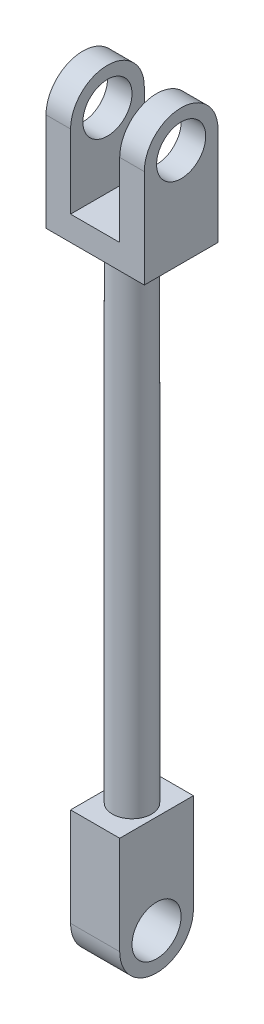
ISO-10303-21;
HEADER;
FILE_DESCRIPTION(('STEP AP214'),'2;1');
FILE_NAME('part.step','',(''),(''),'','','');
FILE_SCHEMA(('AUTOMOTIVE_DESIGN { 1 0 10303 214 1 1 1 1 }'));
ENDSEC;
DATA;
#1=APPLICATION_CONTEXT('core data for automotive mechanical design processes');
#2=APPLICATION_PROTOCOL_DEFINITION('international standard','automotive_design',2000,#1);
#3=PRODUCT_CONTEXT('',#1,'mechanical');
#4=PRODUCT('Part','Part','',(#3));
#5=PRODUCT_RELATED_PRODUCT_CATEGORY('part','',(#4));
#6=PRODUCT_DEFINITION_FORMATION('','',#4);
#7=PRODUCT_DEFINITION_CONTEXT('part definition',#1,'design');
#8=PRODUCT_DEFINITION('design','',#6,#7);
#9=PRODUCT_DEFINITION_SHAPE('','',#8);
#10=(LENGTH_UNIT() NAMED_UNIT(*) SI_UNIT(.MILLI.,.METRE.));
#11=(NAMED_UNIT(*) PLANE_ANGLE_UNIT() SI_UNIT($,.RADIAN.));
#12=(NAMED_UNIT(*) SI_UNIT($,.STERADIAN.) SOLID_ANGLE_UNIT());
#13=UNCERTAINTY_MEASURE_WITH_UNIT(LENGTH_MEASURE(1.E-05),#10,'distance_accuracy_value','');
#14=(GEOMETRIC_REPRESENTATION_CONTEXT(3) GLOBAL_UNCERTAINTY_ASSIGNED_CONTEXT((#13)) GLOBAL_UNIT_ASSIGNED_CONTEXT((#10,
#11,#12)) REPRESENTATION_CONTEXT('',''));
#15=CARTESIAN_POINT('',(0.,0.,0.));
#16=DIRECTION('',(0.,0.,1.));
#17=DIRECTION('',(1.,0.,0.));
#18=AXIS2_PLACEMENT_3D('',#15,#16,#17);
#19=CARTESIAN_POINT('',(10.,70.,0.));
#20=DIRECTION('',(-1.,0.,0.));
#21=DIRECTION('',(0.,0.,1.));
#22=AXIS2_PLACEMENT_3D('',#19,#20,#21);
#23=CYLINDRICAL_SURFACE('',#22,7.5);
#24=DIRECTION('',(-1.,0.,0.));
#25=VECTOR('',#24,1.);
#26=CARTESIAN_POINT('',(10.,70.,7.5));
#27=LINE('',#26,#25);
#28=CARTESIAN_POINT('',(-5.,70.,7.5));
#29=VERTEX_POINT('',#28);
#30=CARTESIAN_POINT('',(-10.,70.,7.5));
#31=VERTEX_POINT('',#30);
#32=EDGE_CURVE('E222',#29,#31,#27,.T.);
#33=ORIENTED_EDGE('',*,*,#32,.F.);
#34=CARTESIAN_POINT('',(-5.,70.,0.));
#35=DIRECTION('',(-1.,0.,0.));
#36=DIRECTION('',(0.,0.,1.));
#37=AXIS2_PLACEMENT_3D('',#34,#35,#36);
#38=CIRCLE('',#37,7.5);
#39=CARTESIAN_POINT('',(-5.,70.,-7.5));
#40=VERTEX_POINT('',#39);
#41=EDGE_CURVE('E196',#29,#40,#38,.T.);
#42=ORIENTED_EDGE('',*,*,#41,.T.);
#43=DIRECTION('',(-1.,0.,0.));
#44=VECTOR('',#43,1.);
#45=CARTESIAN_POINT('',(10.,70.,-7.5));
#46=LINE('',#45,#44);
#47=CARTESIAN_POINT('',(-10.,70.,-7.5));
#48=VERTEX_POINT('',#47);
#49=EDGE_CURVE('E226',#40,#48,#46,.T.);
#50=ORIENTED_EDGE('',*,*,#49,.T.);
#51=CARTESIAN_POINT('',(-10.,70.,0.));
#52=DIRECTION('',(1.,0.,0.));
#53=DIRECTION('',(0.,0.,1.));
#54=AXIS2_PLACEMENT_3D('',#51,#52,#53);
#55=CIRCLE('',#54,7.5);
#56=EDGE_CURVE('E216',#48,#31,#55,.T.);
#57=ORIENTED_EDGE('',*,*,#56,.T.);
#58=EDGE_LOOP('',(#33,#42,#50,#57));
#59=FACE_BOUND('',#58,.T.);
#60=ADVANCED_FACE('F40',(#59),#23,.T.);
#61=CARTESIAN_POINT('',(-10.,70.,0.));
#62=DIRECTION('',(1.,0.,0.));
#63=DIRECTION('',(0.,0.,-1.));
#64=AXIS2_PLACEMENT_3D('',#61,#62,#63);
#65=CYLINDRICAL_SURFACE('',#64,5.);
#66=CARTESIAN_POINT('',(-5.,70.,0.));
#67=DIRECTION('',(-1.,0.,0.));
#68=DIRECTION('',(0.,0.,1.));
#69=AXIS2_PLACEMENT_3D('',#66,#67,#68);
#70=CIRCLE('',#69,5.);
#71=CARTESIAN_POINT('',(-5.,70.,5.));
#72=VERTEX_POINT('',#71);
#73=EDGE_CURVE('E195',#72,#72,#70,.F.);
#74=ORIENTED_EDGE('',*,*,#73,.T.);
#75=EDGE_LOOP('',(#74));
#76=FACE_BOUND('',#75,.T.);
#77=CARTESIAN_POINT('',(-10.,70.,0.));
#78=DIRECTION('',(1.,0.,0.));
#79=DIRECTION('',(0.,0.,-1.));
#80=AXIS2_PLACEMENT_3D('',#77,#78,#79);
#81=CIRCLE('',#80,5.);
#82=CARTESIAN_POINT('',(-10.,70.,-5.));
#83=VERTEX_POINT('',#82);
#84=EDGE_CURVE('E199',#83,#83,#81,.T.);
#85=ORIENTED_EDGE('',*,*,#84,.F.);
#86=EDGE_LOOP('',(#85));
#87=FACE_BOUND('',#86,.T.);
#88=ADVANCED_FACE('F236',(#76,#87),#65,.F.);
#89=CARTESIAN_POINT('',(0.,50.,0.));
#90=DIRECTION('',(0.,-1.,0.));
#91=DIRECTION('',(0.,0.,-1.));
#92=AXIS2_PLACEMENT_3D('',#89,#90,#91);
#93=CYLINDRICAL_SURFACE('',#92,4.);
#94=CARTESIAN_POINT('',(0.,50.,0.));
#95=DIRECTION('',(0.,1.,0.));
#96=DIRECTION('',(0.,0.,1.));
#97=AXIS2_PLACEMENT_3D('',#94,#95,#96);
#98=CIRCLE('',#97,4.);
#99=CARTESIAN_POINT('',(0.,50.,4.));
#100=VERTEX_POINT('',#99);
#101=EDGE_CURVE('E11',#100,#100,#98,.T.);
#102=ORIENTED_EDGE('',*,*,#101,.F.);
#103=EDGE_LOOP('',(#102));
#104=FACE_BOUND('',#103,.T.);
#105=CARTESIAN_POINT('',(0.,-50.,0.));
#106=DIRECTION('',(0.,-1.,0.));
#107=DIRECTION('',(0.,0.,-1.));
#108=AXIS2_PLACEMENT_3D('',#105,#106,#107);
#109=CIRCLE('',#108,4.);
#110=CARTESIAN_POINT('',(0.,-50.,-4.));
#111=VERTEX_POINT('',#110);
#112=EDGE_CURVE('E165',#111,#111,#109,.T.);
#113=ORIENTED_EDGE('',*,*,#112,.F.);
#114=EDGE_LOOP('',(#113));
#115=FACE_BOUND('',#114,.T.);
#116=ADVANCED_FACE('F42',(#104,#115),#93,.T.);
#117=CARTESIAN_POINT('',(10.,50.,0.));
#118=DIRECTION('',(0.,1.,0.));
#119=DIRECTION('',(0.,0.,1.));
#120=AXIS2_PLACEMENT_3D('',#117,#118,#119);
#121=PLANE('',#120);
#122=DIRECTION('',(0.,0.,-1.));
#123=VECTOR('',#122,1.);
#124=CARTESIAN_POINT('',(-10.,50.,0.));
#125=LINE('',#124,#123);
#126=CARTESIAN_POINT('',(-10.,50.,7.5));
#127=VERTEX_POINT('',#126);
#128=CARTESIAN_POINT('',(-10.,50.,-7.5));
#129=VERTEX_POINT('',#128);
#130=EDGE_CURVE('E87',#127,#129,#125,.T.);
#131=ORIENTED_EDGE('',*,*,#130,.T.);
#132=DIRECTION('',(-1.,0.,0.));
#133=VECTOR('',#132,1.);
#134=CARTESIAN_POINT('',(10.,50.,-7.5));
#135=LINE('',#134,#133);
#136=CARTESIAN_POINT('',(10.,50.,-7.5));
#137=VERTEX_POINT('',#136);
#138=EDGE_CURVE('E49',#137,#129,#135,.T.);
#139=ORIENTED_EDGE('',*,*,#138,.F.);
#140=DIRECTION('',(0.,0.,-1.));
#141=VECTOR('',#140,1.);
#142=CARTESIAN_POINT('',(10.,50.,0.));
#143=LINE('',#142,#141);
#144=CARTESIAN_POINT('',(10.,50.,7.5));
#145=VERTEX_POINT('',#144);
#146=EDGE_CURVE('E92',#145,#137,#143,.T.);
#147=ORIENTED_EDGE('',*,*,#146,.F.);
#148=DIRECTION('',(-1.,0.,0.));
#149=VECTOR('',#148,1.);
#150=CARTESIAN_POINT('',(10.,50.,7.5));
#151=LINE('',#150,#149);
#152=EDGE_CURVE('E211',#145,#127,#151,.T.);
#153=ORIENTED_EDGE('',*,*,#152,.T.);
#154=EDGE_LOOP('',(#131,#139,#147,#153));
#155=FACE_BOUND('',#154,.T.);
#156=ORIENTED_EDGE('',*,*,#101,.T.);
#157=EDGE_LOOP('',(#156));
#158=FACE_BOUND('',#157,.T.);
#159=ADVANCED_FACE('F262',(#155,#158),#121,.F.);
#160=CARTESIAN_POINT('',(10.,50.,-7.5));
#161=DIRECTION('',(0.,0.,1.));
#162=DIRECTION('',(1.,0.,0.));
#163=AXIS2_PLACEMENT_3D('',#160,#161,#162);
#164=PLANE('',#163);
#165=ORIENTED_EDGE('',*,*,#49,.F.);
#166=DIRECTION('',(0.,-1.,0.));
#167=VECTOR('',#166,1.);
#168=CARTESIAN_POINT('',(-5.,55.,-7.5));
#169=LINE('',#168,#167);
#170=CARTESIAN_POINT('',(-5.,55.,-7.5));
#171=VERTEX_POINT('',#170);
#172=EDGE_CURVE('E174',#40,#171,#169,.T.);
#173=ORIENTED_EDGE('',*,*,#172,.T.);
#174=DIRECTION('',(1.,0.,0.));
#175=VECTOR('',#174,1.);
#176=CARTESIAN_POINT('',(-5.,55.,-7.5));
#177=LINE('',#176,#175);
#178=CARTESIAN_POINT('',(5.,55.,-7.5));
#179=VERTEX_POINT('',#178);
#180=EDGE_CURVE('E177',#171,#179,#177,.T.);
#181=ORIENTED_EDGE('',*,*,#180,.T.);
#182=DIRECTION('',(0.,1.,0.));
#183=VECTOR('',#182,1.);
#184=CARTESIAN_POINT('',(5.,55.,-7.5));
#185=LINE('',#184,#183);
#186=CARTESIAN_POINT('',(5.,70.,-7.5));
#187=VERTEX_POINT('',#186);
#188=EDGE_CURVE('E181',#179,#187,#185,.T.);
#189=ORIENTED_EDGE('',*,*,#188,.T.);
#190=CARTESIAN_POINT('',(10.,70.,-7.5));
#191=VERTEX_POINT('',#190);
#192=EDGE_CURVE('E227',#191,#187,#46,.T.);
#193=ORIENTED_EDGE('',*,*,#192,.F.);
#194=DIRECTION('',(0.,1.,0.));
#195=VECTOR('',#194,1.);
#196=CARTESIAN_POINT('',(10.,50.,-7.5));
#197=LINE('',#196,#195);
#198=EDGE_CURVE('E205',#137,#191,#197,.T.);
#199=ORIENTED_EDGE('',*,*,#198,.F.);
#200=ORIENTED_EDGE('',*,*,#138,.T.);
#201=DIRECTION('',(0.,1.,0.));
#202=VECTOR('',#201,1.);
#203=CARTESIAN_POINT('',(-10.,50.,-7.5));
#204=LINE('',#203,#202);
#205=EDGE_CURVE('E213',#129,#48,#204,.T.);
#206=ORIENTED_EDGE('',*,*,#205,.T.);
#207=EDGE_LOOP('',(#165,#173,#181,#189,#193,#199,#200,#206));
#208=FACE_BOUND('',#207,.T.);
#209=ADVANCED_FACE('F258',(#208),#164,.F.);
#210=ORIENTED_EDGE('',*,*,#192,.T.);
#211=CARTESIAN_POINT('',(5.,70.,0.));
#212=DIRECTION('',(1.,0.,0.));
#213=DIRECTION('',(0.,0.,-1.));
#214=AXIS2_PLACEMENT_3D('',#211,#212,#213);
#215=CIRCLE('',#214,7.5);
#216=CARTESIAN_POINT('',(5.,70.,7.5));
#217=VERTEX_POINT('',#216);
#218=EDGE_CURVE('E193',#187,#217,#215,.T.);
#219=ORIENTED_EDGE('',*,*,#218,.T.);
#220=CARTESIAN_POINT('',(10.,70.,7.5));
#221=VERTEX_POINT('',#220);
#222=EDGE_CURVE('E223',#221,#217,#27,.T.);
#223=ORIENTED_EDGE('',*,*,#222,.F.);
#224=CARTESIAN_POINT('',(10.,70.,0.));
#225=DIRECTION('',(1.,0.,0.));
#226=DIRECTION('',(0.,0.,1.));
#227=AXIS2_PLACEMENT_3D('',#224,#225,#226);
#228=CIRCLE('',#227,7.5);
#229=EDGE_CURVE('E208',#191,#221,#228,.T.);
#230=ORIENTED_EDGE('',*,*,#229,.F.);
#231=EDGE_LOOP('',(#210,#219,#223,#230));
#232=FACE_BOUND('',#231,.T.);
#233=ADVANCED_FACE('F269',(#232),#23,.T.);
#234=CARTESIAN_POINT('',(10.,50.,7.5));
#235=DIRECTION('',(0.,0.,-1.));
#236=DIRECTION('',(-1.,0.,0.));
#237=AXIS2_PLACEMENT_3D('',#234,#235,#236);
#238=PLANE('',#237);
#239=DIRECTION('',(1.,0.,0.));
#240=VECTOR('',#239,1.);
#241=CARTESIAN_POINT('',(-5.,55.,7.5));
#242=LINE('',#241,#240);
#243=CARTESIAN_POINT('',(-5.,55.,7.5));
#244=VERTEX_POINT('',#243);
#245=CARTESIAN_POINT('',(5.,55.,7.5));
#246=VERTEX_POINT('',#245);
#247=EDGE_CURVE('E185',#244,#246,#242,.T.);
#248=ORIENTED_EDGE('',*,*,#247,.F.);
#249=DIRECTION('',(0.,-1.,0.));
#250=VECTOR('',#249,1.);
#251=CARTESIAN_POINT('',(-5.,55.,7.5));
#252=LINE('',#251,#250);
#253=EDGE_CURVE('E168',#29,#244,#252,.T.);
#254=ORIENTED_EDGE('',*,*,#253,.F.);
#255=ORIENTED_EDGE('',*,*,#32,.T.);
#256=DIRECTION('',(0.,-1.,0.));
#257=VECTOR('',#256,1.);
#258=CARTESIAN_POINT('',(-10.,50.,7.5));
#259=LINE('',#258,#257);
#260=EDGE_CURVE('E206',#31,#127,#259,.T.);
#261=ORIENTED_EDGE('',*,*,#260,.T.);
#262=ORIENTED_EDGE('',*,*,#152,.F.);
#263=DIRECTION('',(0.,-1.,0.));
#264=VECTOR('',#263,1.);
#265=CARTESIAN_POINT('',(10.,50.,7.5));
#266=LINE('',#265,#264);
#267=EDGE_CURVE('E66',#221,#145,#266,.T.);
#268=ORIENTED_EDGE('',*,*,#267,.F.);
#269=ORIENTED_EDGE('',*,*,#222,.T.);
#270=DIRECTION('',(0.,1.,0.));
#271=VECTOR('',#270,1.);
#272=CARTESIAN_POINT('',(5.,55.,7.5));
#273=LINE('',#272,#271);
#274=EDGE_CURVE('E178',#246,#217,#273,.T.);
#275=ORIENTED_EDGE('',*,*,#274,.F.);
#276=EDGE_LOOP('',(#248,#254,#255,#261,#262,#268,#269,#275));
#277=FACE_BOUND('',#276,.T.);
#278=ADVANCED_FACE('F251',(#277),#238,.F.);
#279=CARTESIAN_POINT('',(10.,70.,0.));
#280=DIRECTION('',(-1.,0.,0.));
#281=DIRECTION('',(0.,0.,1.));
#282=AXIS2_PLACEMENT_3D('',#279,#280,#281);
#283=PLANE('',#282);
#284=CARTESIAN_POINT('',(10.,70.,0.));
#285=DIRECTION('',(1.,0.,0.));
#286=DIRECTION('',(0.,0.,-1.));
#287=AXIS2_PLACEMENT_3D('',#284,#285,#286);
#288=CIRCLE('',#287,5.);
#289=CARTESIAN_POINT('',(10.,70.,-5.));
#290=VERTEX_POINT('',#289);
#291=EDGE_CURVE('E198',#290,#290,#288,.T.);
#292=ORIENTED_EDGE('',*,*,#291,.F.);
#293=EDGE_LOOP('',(#292));
#294=FACE_BOUND('',#293,.T.);
#295=ORIENTED_EDGE('',*,*,#146,.T.);
#296=ORIENTED_EDGE('',*,*,#198,.T.);
#297=ORIENTED_EDGE('',*,*,#229,.T.);
#298=ORIENTED_EDGE('',*,*,#267,.T.);
#299=EDGE_LOOP('',(#295,#296,#297,#298));
#300=FACE_BOUND('',#299,.T.);
#301=ADVANCED_FACE('F266',(#294,#300),#283,.F.);
#302=CARTESIAN_POINT('',(-10.,70.,0.));
#303=DIRECTION('',(-1.,0.,0.));
#304=DIRECTION('',(0.,0.,1.));
#305=AXIS2_PLACEMENT_3D('',#302,#303,#304);
#306=PLANE('',#305);
#307=ORIENTED_EDGE('',*,*,#84,.T.);
#308=EDGE_LOOP('',(#307));
#309=FACE_BOUND('',#308,.T.);
#310=ORIENTED_EDGE('',*,*,#130,.F.);
#311=ORIENTED_EDGE('',*,*,#260,.F.);
#312=ORIENTED_EDGE('',*,*,#56,.F.);
#313=ORIENTED_EDGE('',*,*,#205,.F.);
#314=EDGE_LOOP('',(#310,#311,#312,#313));
#315=FACE_BOUND('',#314,.T.);
#316=ADVANCED_FACE('F289',(#309,#315),#306,.T.);
#317=CARTESIAN_POINT('',(5.,70.,0.));
#318=DIRECTION('',(1.,0.,0.));
#319=DIRECTION('',(0.,0.,-1.));
#320=AXIS2_PLACEMENT_3D('',#317,#318,#319);
#321=CIRCLE('',#320,5.);
#322=CARTESIAN_POINT('',(5.,70.,-5.));
#323=VERTEX_POINT('',#322);
#324=EDGE_CURVE('E191',#323,#323,#321,.F.);
#325=ORIENTED_EDGE('',*,*,#324,.T.);
#326=EDGE_LOOP('',(#325));
#327=FACE_BOUND('',#326,.T.);
#328=ORIENTED_EDGE('',*,*,#291,.T.);
#329=EDGE_LOOP('',(#328));
#330=FACE_BOUND('',#329,.T.);
#331=ADVANCED_FACE('F243',(#327,#330),#65,.F.);
#332=CARTESIAN_POINT('',(-5.,55.,-7.5));
#333=DIRECTION('',(-1.,0.,0.));
#334=DIRECTION('',(0.,0.,1.));
#335=AXIS2_PLACEMENT_3D('',#332,#333,#334);
#336=PLANE('',#335);
#337=ORIENTED_EDGE('',*,*,#73,.F.);
#338=EDGE_LOOP('',(#337));
#339=FACE_BOUND('',#338,.T.);
#340=ORIENTED_EDGE('',*,*,#253,.T.);
#341=DIRECTION('',(0.,0.,1.));
#342=VECTOR('',#341,1.);
#343=CARTESIAN_POINT('',(-5.,55.,-7.5));
#344=LINE('',#343,#342);
#345=EDGE_CURVE('E57',#171,#244,#344,.T.);
#346=ORIENTED_EDGE('',*,*,#345,.F.);
#347=ORIENTED_EDGE('',*,*,#172,.F.);
#348=ORIENTED_EDGE('',*,*,#41,.F.);
#349=EDGE_LOOP('',(#340,#346,#347,#348));
#350=FACE_BOUND('',#349,.T.);
#351=ADVANCED_FACE('F239',(#339,#350),#336,.F.);
#352=CARTESIAN_POINT('',(5.,55.,-7.5));
#353=DIRECTION('',(1.,0.,0.));
#354=DIRECTION('',(0.,0.,-1.));
#355=AXIS2_PLACEMENT_3D('',#352,#353,#354);
#356=PLANE('',#355);
#357=ORIENTED_EDGE('',*,*,#324,.F.);
#358=EDGE_LOOP('',(#357));
#359=FACE_BOUND('',#358,.T.);
#360=ORIENTED_EDGE('',*,*,#188,.F.);
#361=DIRECTION('',(0.,0.,1.));
#362=VECTOR('',#361,1.);
#363=CARTESIAN_POINT('',(5.,55.,-7.5));
#364=LINE('',#363,#362);
#365=EDGE_CURVE('E189',#179,#246,#364,.T.);
#366=ORIENTED_EDGE('',*,*,#365,.T.);
#367=ORIENTED_EDGE('',*,*,#274,.T.);
#368=ORIENTED_EDGE('',*,*,#218,.F.);
#369=EDGE_LOOP('',(#360,#366,#367,#368));
#370=FACE_BOUND('',#369,.T.);
#371=ADVANCED_FACE('F242',(#359,#370),#356,.F.);
#372=CARTESIAN_POINT('',(-5.,55.,-7.5));
#373=DIRECTION('',(0.,-1.,0.));
#374=DIRECTION('',(0.,0.,-1.));
#375=AXIS2_PLACEMENT_3D('',#372,#373,#374);
#376=PLANE('',#375);
#377=ORIENTED_EDGE('',*,*,#247,.T.);
#378=ORIENTED_EDGE('',*,*,#365,.F.);
#379=ORIENTED_EDGE('',*,*,#180,.F.);
#380=ORIENTED_EDGE('',*,*,#345,.T.);
#381=EDGE_LOOP('',(#377,#378,#379,#380));
#382=FACE_BOUND('',#381,.T.);
#383=ADVANCED_FACE('F252',(#382),#376,.F.);
#384=CARTESIAN_POINT('',(5.,-50.,7.5));
#385=DIRECTION('',(0.,-1.,0.));
#386=DIRECTION('',(0.,0.,-1.));
#387=AXIS2_PLACEMENT_3D('',#384,#385,#386);
#388=PLANE('',#387);
#389=DIRECTION('',(0.,0.,1.));
#390=VECTOR('',#389,1.);
#391=CARTESIAN_POINT('',(-5.,-50.,7.5));
#392=LINE('',#391,#390);
#393=CARTESIAN_POINT('',(-5.,-50.,-7.5));
#394=VERTEX_POINT('',#393);
#395=CARTESIAN_POINT('',(-5.,-50.,7.5));
#396=VERTEX_POINT('',#395);
#397=EDGE_CURVE('E160',#394,#396,#392,.T.);
#398=ORIENTED_EDGE('',*,*,#397,.T.);
#399=DIRECTION('',(-1.,0.,0.));
#400=VECTOR('',#399,1.);
#401=CARTESIAN_POINT('',(5.,-50.,7.5));
#402=LINE('',#401,#400);
#403=CARTESIAN_POINT('',(5.,-50.,7.5));
#404=VERTEX_POINT('',#403);
#405=EDGE_CURVE('E496',#404,#396,#402,.T.);
#406=ORIENTED_EDGE('',*,*,#405,.F.);
#407=DIRECTION('',(0.,0.,1.));
#408=VECTOR('',#407,1.);
#409=CARTESIAN_POINT('',(5.,-50.,7.5));
#410=LINE('',#409,#408);
#411=CARTESIAN_POINT('',(5.,-50.,-7.5));
#412=VERTEX_POINT('',#411);
#413=EDGE_CURVE('E156',#412,#404,#410,.T.);
#414=ORIENTED_EDGE('',*,*,#413,.F.);
#415=DIRECTION('',(-1.,0.,0.));
#416=VECTOR('',#415,1.);
#417=CARTESIAN_POINT('',(5.,-50.,-7.5));
#418=LINE('',#417,#416);
#419=EDGE_CURVE('E170',#412,#394,#418,.T.);
#420=ORIENTED_EDGE('',*,*,#419,.T.);
#421=EDGE_LOOP('',(#398,#406,#414,#420));
#422=FACE_BOUND('',#421,.T.);
#423=ORIENTED_EDGE('',*,*,#112,.T.);
#424=EDGE_LOOP('',(#423));
#425=FACE_BOUND('',#424,.T.);
#426=ADVANCED_FACE('F339',(#422,#425),#388,.F.);
#427=CARTESIAN_POINT('',(5.,-50.,7.5));
#428=DIRECTION('',(0.,0.,-1.));
#429=DIRECTION('',(0.,1.,0.));
#430=AXIS2_PLACEMENT_3D('',#427,#428,#429);
#431=PLANE('',#430);
#432=DIRECTION('',(0.,-1.,0.));
#433=VECTOR('',#432,1.);
#434=CARTESIAN_POINT('',(-5.,-50.,7.5));
#435=LINE('',#434,#433);
#436=CARTESIAN_POINT('',(-5.,-70.,7.5));
#437=VERTEX_POINT('',#436);
#438=EDGE_CURVE('E164',#396,#437,#435,.T.);
#439=ORIENTED_EDGE('',*,*,#438,.T.);
#440=DIRECTION('',(-1.,0.,0.));
#441=VECTOR('',#440,1.);
#442=CARTESIAN_POINT('',(5.,-70.,7.5));
#443=LINE('',#442,#441);
#444=CARTESIAN_POINT('',(5.,-70.,7.5));
#445=VERTEX_POINT('',#444);
#446=EDGE_CURVE('E144',#445,#437,#443,.T.);
#447=ORIENTED_EDGE('',*,*,#446,.F.);
#448=DIRECTION('',(0.,-1.,0.));
#449=VECTOR('',#448,1.);
#450=CARTESIAN_POINT('',(5.,-50.,7.5));
#451=LINE('',#450,#449);
#452=EDGE_CURVE('E151',#404,#445,#451,.T.);
#453=ORIENTED_EDGE('',*,*,#452,.F.);
#454=ORIENTED_EDGE('',*,*,#405,.T.);
#455=EDGE_LOOP('',(#439,#447,#453,#454));
#456=FACE_BOUND('',#455,.T.);
#457=ADVANCED_FACE('F162',(#456),#431,.F.);
#458=CARTESIAN_POINT('',(5.,-70.,0.));
#459=DIRECTION('',(-1.,0.,0.));
#460=DIRECTION('',(0.,0.,1.));
#461=AXIS2_PLACEMENT_3D('',#458,#459,#460);
#462=CYLINDRICAL_SURFACE('',#461,7.5);
#463=CARTESIAN_POINT('',(-5.,-70.,0.));
#464=DIRECTION('',(1.,0.,0.));
#465=DIRECTION('',(0.,0.,-1.));
#466=AXIS2_PLACEMENT_3D('',#463,#464,#465);
#467=CIRCLE('',#466,7.5);
#468=CARTESIAN_POINT('',(-5.,-70.,-7.5));
#469=VERTEX_POINT('',#468);
#470=EDGE_CURVE('E491',#437,#469,#467,.T.);
#471=ORIENTED_EDGE('',*,*,#470,.T.);
#472=DIRECTION('',(-1.,0.,0.));
#473=VECTOR('',#472,1.);
#474=CARTESIAN_POINT('',(5.,-70.,-7.5));
#475=LINE('',#474,#473);
#476=CARTESIAN_POINT('',(5.,-70.,-7.5));
#477=VERTEX_POINT('',#476);
#478=EDGE_CURVE('E147',#477,#469,#475,.T.);
#479=ORIENTED_EDGE('',*,*,#478,.F.);
#480=CARTESIAN_POINT('',(5.,-70.,0.));
#481=DIRECTION('',(1.,0.,0.));
#482=DIRECTION('',(0.,0.,-1.));
#483=AXIS2_PLACEMENT_3D('',#480,#481,#482);
#484=CIRCLE('',#483,7.5);
#485=EDGE_CURVE('E140',#445,#477,#484,.T.);
#486=ORIENTED_EDGE('',*,*,#485,.F.);
#487=ORIENTED_EDGE('',*,*,#446,.T.);
#488=EDGE_LOOP('',(#471,#479,#486,#487));
#489=FACE_BOUND('',#488,.T.);
#490=ADVANCED_FACE('F142',(#489),#462,.T.);
#491=CARTESIAN_POINT('',(5.,-50.,-7.5));
#492=DIRECTION('',(0.,0.,1.));
#493=DIRECTION('',(0.,-1.,0.));
#494=AXIS2_PLACEMENT_3D('',#491,#492,#493);
#495=PLANE('',#494);
#496=DIRECTION('',(0.,1.,0.));
#497=VECTOR('',#496,1.);
#498=CARTESIAN_POINT('',(-5.,-50.,-7.5));
#499=LINE('',#498,#497);
#500=EDGE_CURVE('E499',#469,#394,#499,.T.);
#501=ORIENTED_EDGE('',*,*,#500,.T.);
#502=ORIENTED_EDGE('',*,*,#419,.F.);
#503=DIRECTION('',(0.,1.,0.));
#504=VECTOR('',#503,1.);
#505=CARTESIAN_POINT('',(5.,-50.,-7.5));
#506=LINE('',#505,#504);
#507=EDGE_CURVE('E150',#477,#412,#506,.T.);
#508=ORIENTED_EDGE('',*,*,#507,.F.);
#509=ORIENTED_EDGE('',*,*,#478,.T.);
#510=EDGE_LOOP('',(#501,#502,#508,#509));
#511=FACE_BOUND('',#510,.T.);
#512=ADVANCED_FACE('F365',(#511),#495,.F.);
#513=CARTESIAN_POINT('',(5.,-70.,0.));
#514=DIRECTION('',(1.,0.,0.));
#515=DIRECTION('',(0.,0.,-1.));
#516=AXIS2_PLACEMENT_3D('',#513,#514,#515);
#517=PLANE('',#516);
#518=CARTESIAN_POINT('',(5.,-70.,0.));
#519=DIRECTION('',(1.,0.,0.));
#520=DIRECTION('',(0.,0.,-1.));
#521=AXIS2_PLACEMENT_3D('',#518,#519,#520);
#522=CIRCLE('',#521,5.);
#523=CARTESIAN_POINT('',(5.,-70.,-5.00000000000001));
#524=VERTEX_POINT('',#523);
#525=EDGE_CURVE('E488',#524,#524,#522,.T.);
#526=ORIENTED_EDGE('',*,*,#525,.F.);
#527=EDGE_LOOP('',(#526));
#528=FACE_BOUND('',#527,.T.);
#529=ORIENTED_EDGE('',*,*,#452,.T.);
#530=ORIENTED_EDGE('',*,*,#485,.T.);
#531=ORIENTED_EDGE('',*,*,#507,.T.);
#532=ORIENTED_EDGE('',*,*,#413,.T.);
#533=EDGE_LOOP('',(#529,#530,#531,#532));
#534=FACE_BOUND('',#533,.T.);
#535=ADVANCED_FACE('F154',(#528,#534),#517,.T.);
#536=CARTESIAN_POINT('',(-5.,-70.,0.));
#537=DIRECTION('',(1.,0.,0.));
#538=DIRECTION('',(0.,0.,-1.));
#539=AXIS2_PLACEMENT_3D('',#536,#537,#538);
#540=PLANE('',#539);
#541=CARTESIAN_POINT('',(-5.,-70.,0.));
#542=DIRECTION('',(1.,0.,0.));
#543=DIRECTION('',(0.,0.,-1.));
#544=AXIS2_PLACEMENT_3D('',#541,#542,#543);
#545=CIRCLE('',#544,5.);
#546=CARTESIAN_POINT('',(-5.,-70.,-5.00000000000001));
#547=VERTEX_POINT('',#546);
#548=EDGE_CURVE('E44',#547,#547,#545,.T.);
#549=ORIENTED_EDGE('',*,*,#548,.T.);
#550=EDGE_LOOP('',(#549));
#551=FACE_BOUND('',#550,.T.);
#552=ORIENTED_EDGE('',*,*,#438,.F.);
#553=ORIENTED_EDGE('',*,*,#397,.F.);
#554=ORIENTED_EDGE('',*,*,#500,.F.);
#555=ORIENTED_EDGE('',*,*,#470,.F.);
#556=EDGE_LOOP('',(#552,#553,#554,#555));
#557=FACE_BOUND('',#556,.T.);
#558=ADVANCED_FACE('F383',(#551,#557),#540,.F.);
#559=CARTESIAN_POINT('',(-15.,-70.,0.));
#560=DIRECTION('',(1.,0.,0.));
#561=DIRECTION('',(0.,0.,-1.));
#562=AXIS2_PLACEMENT_3D('',#559,#560,#561);
#563=CYLINDRICAL_SURFACE('',#562,5.);
#564=ORIENTED_EDGE('',*,*,#525,.T.);
#565=EDGE_LOOP('',(#564));
#566=FACE_BOUND('',#565,.T.);
#567=ORIENTED_EDGE('',*,*,#548,.F.);
#568=EDGE_LOOP('',(#567));
#569=FACE_BOUND('',#568,.T.);
#570=ADVANCED_FACE('F393',(#566,#569),#563,.F.);
#571=CLOSED_SHELL('',(#60,#88,#116,#159,#209,#233,#278,#301,#316,#331,#351,#371,#383,#426,#457,
#490,#512,#535,#558,#570));
#572=MANIFOLD_SOLID_BREP('B2',#571);
#573=ADVANCED_BREP_SHAPE_REPRESENTATION('',(#18,#572),#14);
#574=SHAPE_DEFINITION_REPRESENTATION(#9,#573);
ENDSEC;
END-ISO-10303-21;
